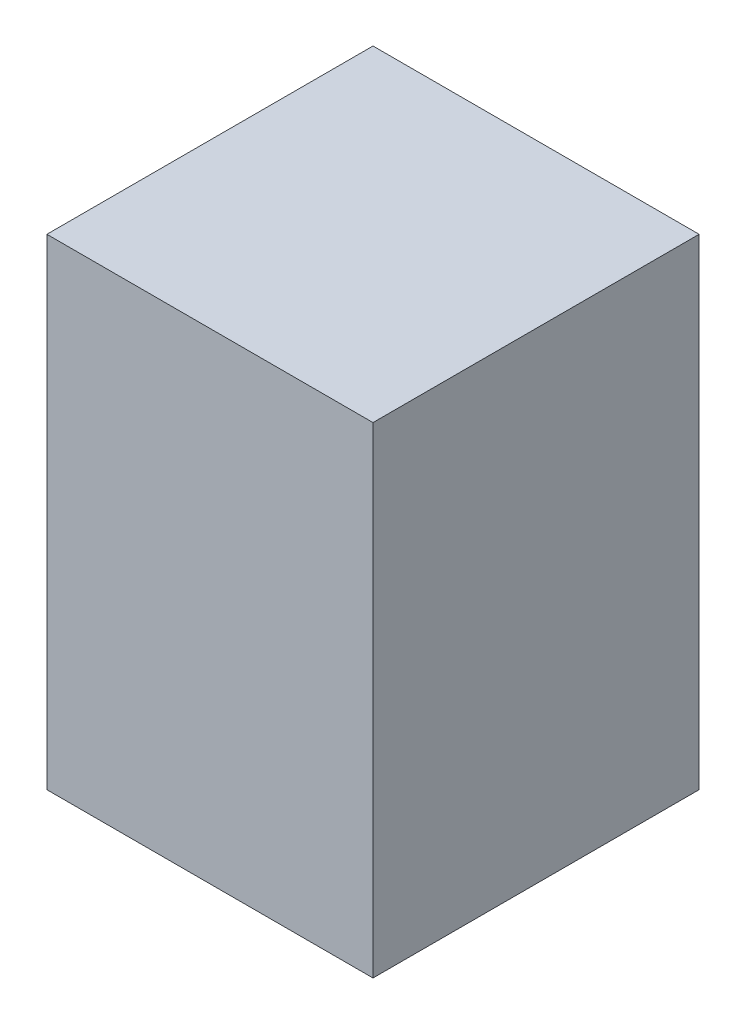
ISO-10303-21;
HEADER;
FILE_DESCRIPTION(('STEP AP214'),'2;1');
FILE_NAME('part.step','',(''),(''),'','','');
FILE_SCHEMA(('AUTOMOTIVE_DESIGN { 1 0 10303 214 1 1 1 1 }'));
ENDSEC;
DATA;
#1=APPLICATION_CONTEXT('core data for automotive mechanical design processes');
#2=APPLICATION_PROTOCOL_DEFINITION('international standard','automotive_design',2000,#1);
#3=PRODUCT_CONTEXT('',#1,'mechanical');
#4=PRODUCT('Part','Part','',(#3));
#5=PRODUCT_RELATED_PRODUCT_CATEGORY('part','',(#4));
#6=PRODUCT_DEFINITION_FORMATION('','',#4);
#7=PRODUCT_DEFINITION_CONTEXT('part definition',#1,'design');
#8=PRODUCT_DEFINITION('design','',#6,#7);
#9=PRODUCT_DEFINITION_SHAPE('','',#8);
#10=(LENGTH_UNIT() NAMED_UNIT(*) SI_UNIT(.MILLI.,.METRE.));
#11=(NAMED_UNIT(*) PLANE_ANGLE_UNIT() SI_UNIT($,.RADIAN.));
#12=(NAMED_UNIT(*) SI_UNIT($,.STERADIAN.) SOLID_ANGLE_UNIT());
#13=UNCERTAINTY_MEASURE_WITH_UNIT(LENGTH_MEASURE(1.E-05),#10,'distance_accuracy_value','');
#14=(GEOMETRIC_REPRESENTATION_CONTEXT(3) GLOBAL_UNCERTAINTY_ASSIGNED_CONTEXT((#13)) GLOBAL_UNIT_ASSIGNED_CONTEXT((#10,
#11,#12)) REPRESENTATION_CONTEXT('',''));
#15=CARTESIAN_POINT('',(0.,0.,0.));
#16=DIRECTION('',(0.,0.,1.));
#17=DIRECTION('',(1.,0.,0.));
#18=AXIS2_PLACEMENT_3D('',#15,#16,#17);
#19=CARTESIAN_POINT('',(0.,74.93,0.));
#20=DIRECTION('',(-1.,0.,0.));
#21=DIRECTION('',(0.,0.,1.));
#22=AXIS2_PLACEMENT_3D('',#19,#20,#21);
#23=PLANE('',#22);
#24=DIRECTION('',(0.,0.,-1.));
#25=VECTOR('',#24,1.);
#26=CARTESIAN_POINT('',(0.,0.,0.));
#27=LINE('',#26,#25);
#28=CARTESIAN_POINT('',(0.,0.,0.));
#29=VERTEX_POINT('',#28);
#30=CARTESIAN_POINT('',(0.,0.,-50.8));
#31=VERTEX_POINT('',#30);
#32=EDGE_CURVE('E99',#29,#31,#27,.T.);
#33=ORIENTED_EDGE('',*,*,#32,.F.);
#34=DIRECTION('',(0.,-1.,0.));
#35=VECTOR('',#34,1.);
#36=CARTESIAN_POINT('',(0.,74.93,0.));
#37=LINE('',#36,#35);
#38=CARTESIAN_POINT('',(0.,74.93,0.));
#39=VERTEX_POINT('',#38);
#40=EDGE_CURVE('E11',#39,#29,#37,.T.);
#41=ORIENTED_EDGE('',*,*,#40,.F.);
#42=DIRECTION('',(0.,0.,-1.));
#43=VECTOR('',#42,1.);
#44=CARTESIAN_POINT('',(0.,74.93,0.));
#45=LINE('',#44,#43);
#46=CARTESIAN_POINT('',(0.,74.93,-50.8));
#47=VERTEX_POINT('',#46);
#48=EDGE_CURVE('E94',#39,#47,#45,.T.);
#49=ORIENTED_EDGE('',*,*,#48,.T.);
#50=DIRECTION('',(0.,-1.,0.));
#51=VECTOR('',#50,1.);
#52=CARTESIAN_POINT('',(0.,74.93,-50.8));
#53=LINE('',#52,#51);
#54=EDGE_CURVE('E37',#47,#31,#53,.T.);
#55=ORIENTED_EDGE('',*,*,#54,.T.);
#56=EDGE_LOOP('',(#33,#41,#49,#55));
#57=FACE_BOUND('',#56,.T.);
#58=ADVANCED_FACE('F34',(#57),#23,.T.);
#59=CARTESIAN_POINT('',(0.,74.93,0.));
#60=DIRECTION('',(0.,0.,-1.));
#61=DIRECTION('',(-1.,0.,0.));
#62=AXIS2_PLACEMENT_3D('',#59,#60,#61);
#63=PLANE('',#62);
#64=DIRECTION('',(1.,0.,0.));
#65=VECTOR('',#64,1.);
#66=CARTESIAN_POINT('',(0.,0.,0.));
#67=LINE('',#66,#65);
#68=CARTESIAN_POINT('',(50.8,0.,0.));
#69=VERTEX_POINT('',#68);
#70=EDGE_CURVE('E67',#29,#69,#67,.T.);
#71=ORIENTED_EDGE('',*,*,#70,.T.);
#72=DIRECTION('',(0.,-1.,0.));
#73=VECTOR('',#72,1.);
#74=CARTESIAN_POINT('',(50.8,74.93,0.));
#75=LINE('',#74,#73);
#76=CARTESIAN_POINT('',(50.8,74.93,0.));
#77=VERTEX_POINT('',#76);
#78=EDGE_CURVE('E43',#77,#69,#75,.T.);
#79=ORIENTED_EDGE('',*,*,#78,.F.);
#80=DIRECTION('',(1.,0.,0.));
#81=VECTOR('',#80,1.);
#82=CARTESIAN_POINT('',(0.,74.93,0.));
#83=LINE('',#82,#81);
#84=EDGE_CURVE('E84',#39,#77,#83,.T.);
#85=ORIENTED_EDGE('',*,*,#84,.F.);
#86=ORIENTED_EDGE('',*,*,#40,.T.);
#87=EDGE_LOOP('',(#71,#79,#85,#86));
#88=FACE_BOUND('',#87,.T.);
#89=ADVANCED_FACE('F109',(#88),#63,.F.);
#90=CARTESIAN_POINT('',(50.8,74.93,0.));
#91=DIRECTION('',(-1.,0.,0.));
#92=DIRECTION('',(0.,0.,1.));
#93=AXIS2_PLACEMENT_3D('',#90,#91,#92);
#94=PLANE('',#93);
#95=DIRECTION('',(0.,0.,-1.));
#96=VECTOR('',#95,1.);
#97=CARTESIAN_POINT('',(50.8,0.,0.));
#98=LINE('',#97,#96);
#99=CARTESIAN_POINT('',(50.8,0.,-50.8));
#100=VERTEX_POINT('',#99);
#101=EDGE_CURVE('E91',#69,#100,#98,.T.);
#102=ORIENTED_EDGE('',*,*,#101,.T.);
#103=DIRECTION('',(0.,-1.,0.));
#104=VECTOR('',#103,1.);
#105=CARTESIAN_POINT('',(50.8,74.93,-50.8));
#106=LINE('',#105,#104);
#107=CARTESIAN_POINT('',(50.8,74.93,-50.8));
#108=VERTEX_POINT('',#107);
#109=EDGE_CURVE('E88',#108,#100,#106,.T.);
#110=ORIENTED_EDGE('',*,*,#109,.F.);
#111=DIRECTION('',(0.,0.,-1.));
#112=VECTOR('',#111,1.);
#113=CARTESIAN_POINT('',(50.8,74.93,0.));
#114=LINE('',#113,#112);
#115=EDGE_CURVE('E79',#77,#108,#114,.T.);
#116=ORIENTED_EDGE('',*,*,#115,.F.);
#117=ORIENTED_EDGE('',*,*,#78,.T.);
#118=EDGE_LOOP('',(#102,#110,#116,#117));
#119=FACE_BOUND('',#118,.T.);
#120=ADVANCED_FACE('F89',(#119),#94,.F.);
#121=CARTESIAN_POINT('',(0.,74.93,-50.8));
#122=DIRECTION('',(0.,0.,-1.));
#123=DIRECTION('',(-1.,0.,0.));
#124=AXIS2_PLACEMENT_3D('',#121,#122,#123);
#125=PLANE('',#124);
#126=DIRECTION('',(1.,0.,0.));
#127=VECTOR('',#126,1.);
#128=CARTESIAN_POINT('',(0.,0.,-50.8));
#129=LINE('',#128,#127);
#130=EDGE_CURVE('E102',#31,#100,#129,.T.);
#131=ORIENTED_EDGE('',*,*,#130,.F.);
#132=ORIENTED_EDGE('',*,*,#54,.F.);
#133=DIRECTION('',(1.,0.,0.));
#134=VECTOR('',#133,1.);
#135=CARTESIAN_POINT('',(0.,74.93,-50.8));
#136=LINE('',#135,#134);
#137=EDGE_CURVE('E83',#47,#108,#136,.T.);
#138=ORIENTED_EDGE('',*,*,#137,.T.);
#139=ORIENTED_EDGE('',*,*,#109,.T.);
#140=EDGE_LOOP('',(#131,#132,#138,#139));
#141=FACE_BOUND('',#140,.T.);
#142=ADVANCED_FACE('F93',(#141),#125,.T.);
#143=CARTESIAN_POINT('',(0.,74.93,0.));
#144=DIRECTION('',(0.,-1.,0.));
#145=DIRECTION('',(0.,0.,-1.));
#146=AXIS2_PLACEMENT_3D('',#143,#144,#145);
#147=PLANE('',#146);
#148=ORIENTED_EDGE('',*,*,#48,.F.);
#149=ORIENTED_EDGE('',*,*,#84,.T.);
#150=ORIENTED_EDGE('',*,*,#115,.T.);
#151=ORIENTED_EDGE('',*,*,#137,.F.);
#152=EDGE_LOOP('',(#148,#149,#150,#151));
#153=FACE_BOUND('',#152,.T.);
#154=ADVANCED_FACE('F82',(#153),#147,.F.);
#155=CARTESIAN_POINT('',(0.,0.,0.));
#156=DIRECTION('',(0.,-1.,0.));
#157=DIRECTION('',(0.,0.,-1.));
#158=AXIS2_PLACEMENT_3D('',#155,#156,#157);
#159=PLANE('',#158);
#160=ORIENTED_EDGE('',*,*,#32,.T.);
#161=ORIENTED_EDGE('',*,*,#130,.T.);
#162=ORIENTED_EDGE('',*,*,#101,.F.);
#163=ORIENTED_EDGE('',*,*,#70,.F.);
#164=EDGE_LOOP('',(#160,#161,#162,#163));
#165=FACE_BOUND('',#164,.T.);
#166=ADVANCED_FACE('F107',(#165),#159,.T.);
#167=CLOSED_SHELL('',(#58,#89,#120,#142,#154,#166));
#168=MANIFOLD_SOLID_BREP('B2',#167);
#169=ADVANCED_BREP_SHAPE_REPRESENTATION('',(#18,#168),#14);
#170=SHAPE_DEFINITION_REPRESENTATION(#9,#169);
ENDSEC;
END-ISO-10303-21;
